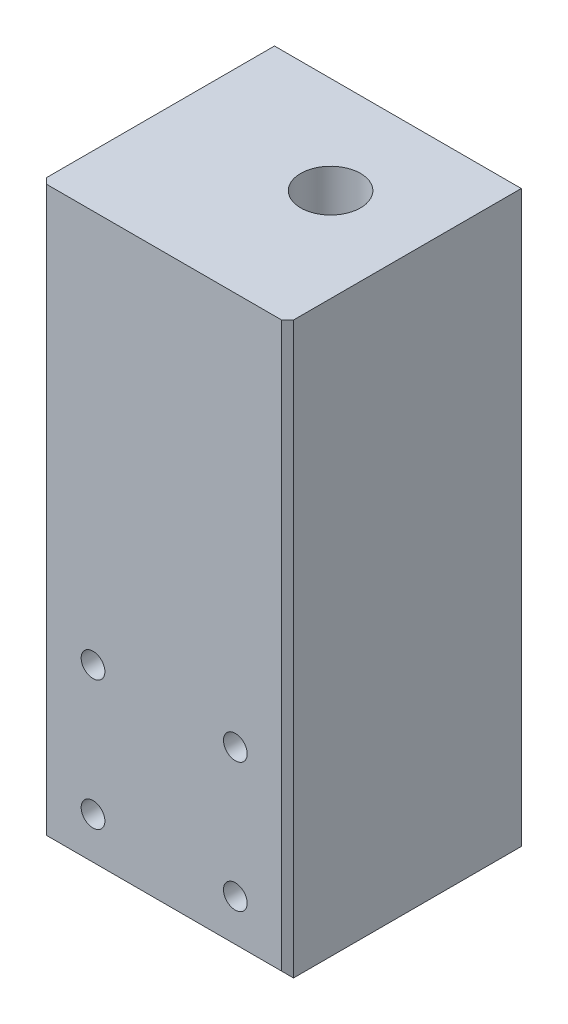
ISO-10303-21;
HEADER;
FILE_DESCRIPTION(('STEP AP214'),'2;1');
FILE_NAME('part.step','',(''),(''),'','','');
FILE_SCHEMA(('AUTOMOTIVE_DESIGN { 1 0 10303 214 1 1 1 1 }'));
ENDSEC;
DATA;
#1=APPLICATION_CONTEXT('core data for automotive mechanical design processes');
#2=APPLICATION_PROTOCOL_DEFINITION('international standard','automotive_design',2000,#1);
#3=PRODUCT_CONTEXT('',#1,'mechanical');
#4=PRODUCT('Part','Part','',(#3));
#5=PRODUCT_RELATED_PRODUCT_CATEGORY('part','',(#4));
#6=PRODUCT_DEFINITION_FORMATION('','',#4);
#7=PRODUCT_DEFINITION_CONTEXT('part definition',#1,'design');
#8=PRODUCT_DEFINITION('design','',#6,#7);
#9=PRODUCT_DEFINITION_SHAPE('','',#8);
#10=(LENGTH_UNIT() NAMED_UNIT(*) SI_UNIT(.MILLI.,.METRE.));
#11=(NAMED_UNIT(*) PLANE_ANGLE_UNIT() SI_UNIT($,.RADIAN.));
#12=(NAMED_UNIT(*) SI_UNIT($,.STERADIAN.) SOLID_ANGLE_UNIT());
#13=UNCERTAINTY_MEASURE_WITH_UNIT(LENGTH_MEASURE(1.E-05),#10,'distance_accuracy_value','');
#14=(GEOMETRIC_REPRESENTATION_CONTEXT(3) GLOBAL_UNCERTAINTY_ASSIGNED_CONTEXT((#13)) GLOBAL_UNIT_ASSIGNED_CONTEXT((#10,
#11,#12)) REPRESENTATION_CONTEXT('',''));
#15=CARTESIAN_POINT('',(0.,0.,0.));
#16=DIRECTION('',(0.,0.,1.));
#17=DIRECTION('',(1.,0.,0.));
#18=AXIS2_PLACEMENT_3D('',#15,#16,#17);
#19=CARTESIAN_POINT('',(145.625,0.,-87.900000000003));
#20=DIRECTION('',(1.,0.,0.));
#21=DIRECTION('',(0.,0.,-1.));
#22=AXIS2_PLACEMENT_3D('',#19,#20,#21);
#23=PLANE('',#22);
#24=DIRECTION('',(0.,0.,1.));
#25=VECTOR('',#24,1.);
#26=CARTESIAN_POINT('',(145.625,152.4,-87.900000000003));
#27=LINE('',#26,#25);
#28=CARTESIAN_POINT('',(145.625,152.4,-87.900000000003));
#29=VERTEX_POINT('',#28);
#30=CARTESIAN_POINT('',(145.625,152.4,-26.9875));
#31=VERTEX_POINT('',#30);
#32=EDGE_CURVE('E94',#29,#31,#27,.T.);
#33=ORIENTED_EDGE('',*,*,#32,.T.);
#34=DIRECTION('',(0.,-1.,0.));
#35=VECTOR('',#34,1.);
#36=CARTESIAN_POINT('',(145.625,0.,-26.9875));
#37=LINE('',#36,#35);
#38=CARTESIAN_POINT('',(145.625,0.,-26.9875));
#39=VERTEX_POINT('',#38);
#40=EDGE_CURVE('E64',#31,#39,#37,.T.);
#41=ORIENTED_EDGE('',*,*,#40,.T.);
#42=DIRECTION('',(0.,0.,1.));
#43=VECTOR('',#42,1.);
#44=CARTESIAN_POINT('',(145.625,0.,-87.900000000003));
#45=LINE('',#44,#43);
#46=CARTESIAN_POINT('',(145.625,0.,-87.900000000003));
#47=VERTEX_POINT('',#46);
#48=EDGE_CURVE('E113',#47,#39,#45,.T.);
#49=ORIENTED_EDGE('',*,*,#48,.F.);
#50=DIRECTION('',(0.,1.,0.));
#51=VECTOR('',#50,1.);
#52=CARTESIAN_POINT('',(145.625,0.,-87.900000000003));
#53=LINE('',#52,#51);
#54=EDGE_CURVE('E108',#47,#29,#53,.T.);
#55=ORIENTED_EDGE('',*,*,#54,.T.);
#56=EDGE_LOOP('',(#33,#41,#49,#55));
#57=FACE_BOUND('',#56,.T.);
#58=ADVANCED_FACE('F39',(#57),#23,.T.);
#59=CARTESIAN_POINT('',(0.,0.,-87.900000000003));
#60=DIRECTION('',(0.,1.,0.));
#61=DIRECTION('',(0.,0.,1.));
#62=AXIS2_PLACEMENT_3D('',#59,#60,#61);
#63=PLANE('',#62);
#64=CARTESIAN_POINT('',(120.624999999984,0.,-61.900000000027));
#65=DIRECTION('',(0.,-1.,0.));
#66=DIRECTION('',(0.,0.,-1.));
#67=AXIS2_PLACEMENT_3D('',#64,#65,#66);
#68=CIRCLE('',#67,8.00000000000001);
#69=CARTESIAN_POINT('',(120.624999999984,0.,-69.900000000027));
#70=VERTEX_POINT('',#69);
#71=EDGE_CURVE('E423',#70,#70,#68,.T.);
#72=ORIENTED_EDGE('',*,*,#71,.F.);
#73=EDGE_LOOP('',(#72));
#74=FACE_BOUND('',#73,.T.);
#75=CARTESIAN_POINT('',(134.060028842528,0.,-48.4649711574826));
#76=DIRECTION('',(0.,-1.,0.));
#77=DIRECTION('',(0.,0.,-1.));
#78=AXIS2_PLACEMENT_3D('',#75,#76,#77);
#79=CIRCLE('',#78,2.75000000000003);
#80=CARTESIAN_POINT('',(134.060028842528,0.,-51.2149711574826));
#81=VERTEX_POINT('',#80);
#82=EDGE_CURVE('E158',#81,#81,#79,.T.);
#83=ORIENTED_EDGE('',*,*,#82,.F.);
#84=EDGE_LOOP('',(#83));
#85=FACE_BOUND('',#84,.T.);
#86=CARTESIAN_POINT('',(120.624999999984,0.,-42.9000000000271));
#87=DIRECTION('',(0.,-1.,0.));
#88=DIRECTION('',(0.,0.,-1.));
#89=AXIS2_PLACEMENT_3D('',#86,#87,#88);
#90=CIRCLE('',#89,2.75);
#91=CARTESIAN_POINT('',(120.624999999984,0.,-45.6500000000271));
#92=VERTEX_POINT('',#91);
#93=EDGE_CURVE('E447',#92,#92,#90,.T.);
#94=ORIENTED_EDGE('',*,*,#93,.F.);
#95=EDGE_LOOP('',(#94));
#96=FACE_BOUND('',#95,.T.);
#97=CARTESIAN_POINT('',(107.189971157439,0.,-48.4649711574826));
#98=DIRECTION('',(0.,-1.,0.));
#99=DIRECTION('',(0.,0.,-1.));
#100=AXIS2_PLACEMENT_3D('',#97,#98,#99);
#101=CIRCLE('',#100,2.75000000000003);
#102=CARTESIAN_POINT('',(107.189971157439,0.,-51.2149711574826));
#103=VERTEX_POINT('',#102);
#104=EDGE_CURVE('E441',#103,#103,#101,.T.);
#105=ORIENTED_EDGE('',*,*,#104,.F.);
#106=EDGE_LOOP('',(#105));
#107=FACE_BOUND('',#106,.T.);
#108=CARTESIAN_POINT('',(107.189971157439,0.,-75.3350288425715));
#109=DIRECTION('',(0.,-1.,0.));
#110=DIRECTION('',(0.,0.,-1.));
#111=AXIS2_PLACEMENT_3D('',#108,#109,#110);
#112=CIRCLE('',#111,2.75000000000003);
#113=CARTESIAN_POINT('',(107.189971157439,0.,-78.0850288425716));
#114=VERTEX_POINT('',#113);
#115=EDGE_CURVE('E435',#114,#114,#112,.T.);
#116=ORIENTED_EDGE('',*,*,#115,.F.);
#117=EDGE_LOOP('',(#116));
#118=FACE_BOUND('',#117,.T.);
#119=CARTESIAN_POINT('',(120.624999999984,0.,-80.900000000027));
#120=DIRECTION('',(0.,-1.,0.));
#121=DIRECTION('',(0.,0.,-1.));
#122=AXIS2_PLACEMENT_3D('',#119,#120,#121);
#123=CIRCLE('',#122,2.75);
#124=CARTESIAN_POINT('',(120.624999999984,0.,-83.650000000027));
#125=VERTEX_POINT('',#124);
#126=EDGE_CURVE('E429',#125,#125,#123,.T.);
#127=ORIENTED_EDGE('',*,*,#126,.F.);
#128=EDGE_LOOP('',(#127));
#129=FACE_BOUND('',#128,.T.);
#130=CARTESIAN_POINT('',(134.060028842528,0.,-75.3350288425715));
#131=DIRECTION('',(0.,-1.,0.));
#132=DIRECTION('',(0.,0.,-1.));
#133=AXIS2_PLACEMENT_3D('',#130,#131,#132);
#134=CIRCLE('',#133,2.75000000000003);
#135=CARTESIAN_POINT('',(134.060028842528,0.,-78.0850288425716));
#136=VERTEX_POINT('',#135);
#137=EDGE_CURVE('E150',#136,#136,#134,.T.);
#138=ORIENTED_EDGE('',*,*,#137,.F.);
#139=EDGE_LOOP('',(#138));
#140=FACE_BOUND('',#139,.T.);
#141=ORIENTED_EDGE('',*,*,#48,.T.);
#142=DIRECTION('',(-1.,0.,0.));
#143=VECTOR('',#142,1.);
#144=CARTESIAN_POINT('',(79.6250000000006,0.,-26.9875));
#145=LINE('',#144,#143);
#146=CARTESIAN_POINT('',(79.6250000000006,0.,-26.9875));
#147=VERTEX_POINT('',#146);
#148=EDGE_CURVE('E49',#39,#147,#145,.T.);
#149=ORIENTED_EDGE('',*,*,#148,.T.);
#150=DIRECTION('',(0.,0.,1.));
#151=VECTOR('',#150,1.);
#152=CARTESIAN_POINT('',(79.6250000000006,0.,-87.900000000003));
#153=LINE('',#152,#151);
#154=CARTESIAN_POINT('',(79.6250000000006,0.,-87.900000000003));
#155=VERTEX_POINT('',#154);
#156=EDGE_CURVE('E128',#155,#147,#153,.T.);
#157=ORIENTED_EDGE('',*,*,#156,.F.);
#158=DIRECTION('',(-1.,0.,0.));
#159=VECTOR('',#158,1.);
#160=CARTESIAN_POINT('',(0.,0.,-87.900000000003));
#161=LINE('',#160,#159);
#162=EDGE_CURVE('E103',#47,#155,#161,.T.);
#163=ORIENTED_EDGE('',*,*,#162,.F.);
#164=EDGE_LOOP('',(#141,#149,#157,#163));
#165=FACE_BOUND('',#164,.T.);
#166=ADVANCED_FACE('F260',(#74,#85,#96,#107,#118,#129,#140,#165),#63,.F.);
#167=CARTESIAN_POINT('',(79.6250000000006,0.,-87.900000000003));
#168=DIRECTION('',(1.,0.,0.));
#169=DIRECTION('',(0.,0.,-1.));
#170=AXIS2_PLACEMENT_3D('',#167,#168,#169);
#171=PLANE('',#170);
#172=ORIENTED_EDGE('',*,*,#156,.T.);
#173=DIRECTION('',(0.,1.,0.));
#174=VECTOR('',#173,1.);
#175=CARTESIAN_POINT('',(79.6250000000006,152.4,-26.9875));
#176=LINE('',#175,#174);
#177=CARTESIAN_POINT('',(79.6250000000006,152.4,-26.9875));
#178=VERTEX_POINT('',#177);
#179=EDGE_CURVE('E11',#147,#178,#176,.T.);
#180=ORIENTED_EDGE('',*,*,#179,.T.);
#181=DIRECTION('',(0.,0.,1.));
#182=VECTOR('',#181,1.);
#183=CARTESIAN_POINT('',(79.6250000000006,152.4,-87.900000000003));
#184=LINE('',#183,#182);
#185=CARTESIAN_POINT('',(79.6250000000006,152.4,-87.900000000003));
#186=VERTEX_POINT('',#185);
#187=EDGE_CURVE('E102',#186,#178,#184,.T.);
#188=ORIENTED_EDGE('',*,*,#187,.F.);
#189=DIRECTION('',(0.,1.,0.));
#190=VECTOR('',#189,1.);
#191=CARTESIAN_POINT('',(79.6250000000006,0.,-87.900000000003));
#192=LINE('',#191,#190);
#193=EDGE_CURVE('E110',#155,#186,#192,.T.);
#194=ORIENTED_EDGE('',*,*,#193,.F.);
#195=EDGE_LOOP('',(#172,#180,#188,#194));
#196=FACE_BOUND('',#195,.T.);
#197=ADVANCED_FACE('F264',(#196),#171,.F.);
#198=CARTESIAN_POINT('',(0.,152.4,-87.900000000003));
#199=DIRECTION('',(0.,1.,0.));
#200=DIRECTION('',(0.,0.,1.));
#201=AXIS2_PLACEMENT_3D('',#198,#199,#200);
#202=PLANE('',#201);
#203=CARTESIAN_POINT('',(120.624999999984,152.4,-61.900000000027));
#204=DIRECTION('',(0.,-1.,0.));
#205=DIRECTION('',(0.,0.,-1.));
#206=AXIS2_PLACEMENT_3D('',#203,#204,#205);
#207=CIRCLE('',#206,8.00000000000001);
#208=CARTESIAN_POINT('',(120.624999999984,152.4,-69.900000000027));
#209=VERTEX_POINT('',#208);
#210=EDGE_CURVE('E420',#209,#209,#207,.T.);
#211=ORIENTED_EDGE('',*,*,#210,.T.);
#212=EDGE_LOOP('',(#211));
#213=FACE_BOUND('',#212,.T.);
#214=DIRECTION('',(-1.,0.,0.));
#215=VECTOR('',#214,1.);
#216=CARTESIAN_POINT('',(0.,152.4,-25.4));
#217=LINE('',#216,#215);
#218=CARTESIAN_POINT('',(144.0375,152.4,-25.4));
#219=VERTEX_POINT('',#218);
#220=CARTESIAN_POINT('',(81.2125000000006,152.4,-25.4));
#221=VERTEX_POINT('',#220);
#222=EDGE_CURVE('E115',#219,#221,#217,.T.);
#223=ORIENTED_EDGE('',*,*,#222,.F.);
#224=DIRECTION('',(-0.707106781186554,0.,0.707106781186541));
#225=VECTOR('',#224,1.);
#226=CARTESIAN_POINT('',(103.26875,152.4,15.3687499999991));
#227=LINE('',#226,#225);
#228=EDGE_CURVE('E100',#219,#31,#227,.F.);
#229=ORIENTED_EDGE('',*,*,#228,.T.);
#230=ORIENTED_EDGE('',*,*,#32,.F.);
#231=DIRECTION('',(-1.,0.,0.));
#232=VECTOR('',#231,1.);
#233=CARTESIAN_POINT('',(0.,152.4,-87.900000000003));
#234=LINE('',#233,#232);
#235=EDGE_CURVE('E99',#29,#186,#234,.T.);
#236=ORIENTED_EDGE('',*,*,#235,.T.);
#237=ORIENTED_EDGE('',*,*,#187,.T.);
#238=DIRECTION('',(0.707106781186554,0.,0.707106781186541));
#239=VECTOR('',#238,1.);
#240=CARTESIAN_POINT('',(9.3562499999981,152.4,-97.2562500000013));
#241=LINE('',#240,#239);
#242=EDGE_CURVE('E137',#178,#221,#241,.T.);
#243=ORIENTED_EDGE('',*,*,#242,.T.);
#244=EDGE_LOOP('',(#223,#229,#230,#236,#237,#243));
#245=FACE_BOUND('',#244,.T.);
#246=ADVANCED_FACE('F97',(#213,#245),#202,.T.);
#247=CARTESIAN_POINT('',(0.,0.,-87.900000000003));
#248=DIRECTION('',(0.,0.,1.));
#249=DIRECTION('',(1.,0.,0.));
#250=AXIS2_PLACEMENT_3D('',#247,#248,#249);
#251=PLANE('',#250);
#252=CARTESIAN_POINT('',(139.275,36.3250000000134,-87.900000000003));
#253=DIRECTION('',(0.,0.,1.));
#254=DIRECTION('',(1.,0.,0.));
#255=AXIS2_PLACEMENT_3D('',#252,#253,#254);
#256=CIRCLE('',#255,1.58749999999999);
#257=CARTESIAN_POINT('',(140.8625,36.3250000000134,-87.900000000003));
#258=VERTEX_POINT('',#257);
#259=EDGE_CURVE('E164',#258,#258,#256,.T.);
#260=ORIENTED_EDGE('',*,*,#259,.T.);
#261=EDGE_LOOP('',(#260));
#262=FACE_BOUND('',#261,.T.);
#263=CARTESIAN_POINT('',(85.6250000000003,7.00000000000009,-87.900000000003));
#264=DIRECTION('',(0.,0.,1.));
#265=DIRECTION('',(1.,0.,0.));
#266=AXIS2_PLACEMENT_3D('',#263,#264,#265);
#267=CIRCLE('',#266,3.3);
#268=CARTESIAN_POINT('',(88.9250000000003,7.00000000000009,-87.900000000003));
#269=VERTEX_POINT('',#268);
#270=EDGE_CURVE('E183',#269,#269,#267,.T.);
#271=ORIENTED_EDGE('',*,*,#270,.T.);
#272=EDGE_LOOP('',(#271));
#273=FACE_BOUND('',#272,.T.);
#274=CARTESIAN_POINT('',(98.6250000000003,7.00000000000009,-87.900000000003));
#275=DIRECTION('',(0.,0.,1.));
#276=DIRECTION('',(1.,0.,0.));
#277=AXIS2_PLACEMENT_3D('',#274,#275,#276);
#278=CIRCLE('',#277,3.3);
#279=CARTESIAN_POINT('',(101.925,7.00000000000009,-87.900000000003));
#280=VERTEX_POINT('',#279);
#281=EDGE_CURVE('E182',#280,#280,#278,.T.);
#282=ORIENTED_EDGE('',*,*,#281,.T.);
#283=EDGE_LOOP('',(#282));
#284=FACE_BOUND('',#283,.T.);
#285=CARTESIAN_POINT('',(85.6250000000003,53.0000000000001,-87.900000000003));
#286=DIRECTION('',(0.,0.,1.));
#287=DIRECTION('',(1.,0.,0.));
#288=AXIS2_PLACEMENT_3D('',#285,#286,#287);
#289=CIRCLE('',#288,3.3);
#290=CARTESIAN_POINT('',(88.9250000000003,53.0000000000001,-87.900000000003));
#291=VERTEX_POINT('',#290);
#292=EDGE_CURVE('E195',#291,#291,#289,.T.);
#293=ORIENTED_EDGE('',*,*,#292,.T.);
#294=EDGE_LOOP('',(#293));
#295=FACE_BOUND('',#294,.T.);
#296=CARTESIAN_POINT('',(113.875,36.3250000000134,-87.900000000003));
#297=DIRECTION('',(0.,0.,1.));
#298=DIRECTION('',(1.,0.,0.));
#299=AXIS2_PLACEMENT_3D('',#296,#297,#298);
#300=CIRCLE('',#299,1.58749999999999);
#301=CARTESIAN_POINT('',(115.4625,36.3250000000134,-87.900000000003));
#302=VERTEX_POINT('',#301);
#303=EDGE_CURVE('E165',#302,#302,#300,.T.);
#304=ORIENTED_EDGE('',*,*,#303,.T.);
#305=EDGE_LOOP('',(#304));
#306=FACE_BOUND('',#305,.T.);
#307=CARTESIAN_POINT('',(113.875,23.6750000000135,-87.900000000003));
#308=DIRECTION('',(0.,0.,1.));
#309=DIRECTION('',(1.,0.,0.));
#310=AXIS2_PLACEMENT_3D('',#307,#308,#309);
#311=CIRCLE('',#310,1.58750000000001);
#312=CARTESIAN_POINT('',(115.4625,23.6750000000135,-87.900000000003));
#313=VERTEX_POINT('',#312);
#314=EDGE_CURVE('E171',#313,#313,#311,.T.);
#315=ORIENTED_EDGE('',*,*,#314,.T.);
#316=EDGE_LOOP('',(#315));
#317=FACE_BOUND('',#316,.T.);
#318=CARTESIAN_POINT('',(139.275,23.6750000000135,-87.900000000003));
#319=DIRECTION('',(0.,0.,1.));
#320=DIRECTION('',(1.,0.,0.));
#321=AXIS2_PLACEMENT_3D('',#318,#319,#320);
#322=CIRCLE('',#321,1.58750000000001);
#323=CARTESIAN_POINT('',(140.8625,23.6750000000135,-87.900000000003));
#324=VERTEX_POINT('',#323);
#325=EDGE_CURVE('E148',#324,#324,#322,.T.);
#326=ORIENTED_EDGE('',*,*,#325,.T.);
#327=EDGE_LOOP('',(#326));
#328=FACE_BOUND('',#327,.T.);
#329=CARTESIAN_POINT('',(98.6250000000003,53.0000000000001,-87.900000000003));
#330=DIRECTION('',(0.,0.,1.));
#331=DIRECTION('',(1.,0.,0.));
#332=AXIS2_PLACEMENT_3D('',#329,#330,#331);
#333=CIRCLE('',#332,3.3);
#334=CARTESIAN_POINT('',(101.925,53.0000000000001,-87.900000000003));
#335=VERTEX_POINT('',#334);
#336=EDGE_CURVE('E194',#335,#335,#333,.T.);
#337=ORIENTED_EDGE('',*,*,#336,.T.);
#338=EDGE_LOOP('',(#337));
#339=FACE_BOUND('',#338,.T.);
#340=ORIENTED_EDGE('',*,*,#54,.F.);
#341=ORIENTED_EDGE('',*,*,#162,.T.);
#342=ORIENTED_EDGE('',*,*,#193,.T.);
#343=ORIENTED_EDGE('',*,*,#235,.F.);
#344=EDGE_LOOP('',(#340,#341,#342,#343));
#345=FACE_BOUND('',#344,.T.);
#346=ADVANCED_FACE('F107',(#262,#273,#284,#295,#306,#317,#328,#339,#345),#251,.F.);
#347=CARTESIAN_POINT('',(0.,0.,-25.4));
#348=DIRECTION('',(0.,0.,1.));
#349=DIRECTION('',(1.,0.,0.));
#350=AXIS2_PLACEMENT_3D('',#347,#348,#349);
#351=PLANE('',#350);
#352=CARTESIAN_POINT('',(131.655,12.7,-25.4));
#353=DIRECTION('',(0.,0.,1.));
#354=DIRECTION('',(1.,0.,0.));
#355=AXIS2_PLACEMENT_3D('',#352,#353,#354);
#356=CIRCLE('',#355,3.175);
#357=CARTESIAN_POINT('',(134.83,12.7,-25.4));
#358=VERTEX_POINT('',#357);
#359=EDGE_CURVE('E212',#358,#358,#356,.T.);
#360=ORIENTED_EDGE('',*,*,#359,.F.);
#361=EDGE_LOOP('',(#360));
#362=FACE_BOUND('',#361,.T.);
#363=CARTESIAN_POINT('',(93.5950000000005,47.3000000000001,-25.4));
#364=DIRECTION('',(0.,0.,1.));
#365=DIRECTION('',(1.,0.,0.));
#366=AXIS2_PLACEMENT_3D('',#363,#364,#365);
#367=CIRCLE('',#366,3.175);
#368=CARTESIAN_POINT('',(96.7700000000005,47.3000000000001,-25.4));
#369=VERTEX_POINT('',#368);
#370=EDGE_CURVE('E218',#369,#369,#367,.T.);
#371=ORIENTED_EDGE('',*,*,#370,.F.);
#372=EDGE_LOOP('',(#371));
#373=FACE_BOUND('',#372,.T.);
#374=CARTESIAN_POINT('',(131.655,47.3000000000001,-25.4));
#375=DIRECTION('',(0.,0.,1.));
#376=DIRECTION('',(1.,0.,0.));
#377=AXIS2_PLACEMENT_3D('',#374,#375,#376);
#378=CIRCLE('',#377,3.175);
#379=CARTESIAN_POINT('',(134.83,47.3000000000001,-25.4));
#380=VERTEX_POINT('',#379);
#381=EDGE_CURVE('E121',#380,#380,#378,.T.);
#382=ORIENTED_EDGE('',*,*,#381,.F.);
#383=EDGE_LOOP('',(#382));
#384=FACE_BOUND('',#383,.T.);
#385=CARTESIAN_POINT('',(93.5950000000005,12.7,-25.4));
#386=DIRECTION('',(0.,0.,1.));
#387=DIRECTION('',(1.,0.,0.));
#388=AXIS2_PLACEMENT_3D('',#385,#386,#387);
#389=CIRCLE('',#388,3.175);
#390=CARTESIAN_POINT('',(96.7700000000005,12.7,-25.4));
#391=VERTEX_POINT('',#390);
#392=EDGE_CURVE('E206',#391,#391,#389,.T.);
#393=ORIENTED_EDGE('',*,*,#392,.F.);
#394=EDGE_LOOP('',(#393));
#395=FACE_BOUND('',#394,.T.);
#396=DIRECTION('',(1.,0.,0.));
#397=VECTOR('',#396,1.);
#398=CARTESIAN_POINT('',(145.625,1.58750000000002,-25.4));
#399=LINE('',#398,#397);
#400=CARTESIAN_POINT('',(81.2125000000006,1.58750000000002,-25.4));
#401=VERTEX_POINT('',#400);
#402=CARTESIAN_POINT('',(144.0375,1.58750000000002,-25.4));
#403=VERTEX_POINT('',#402);
#404=EDGE_CURVE('E132',#401,#403,#399,.T.);
#405=ORIENTED_EDGE('',*,*,#404,.T.);
#406=DIRECTION('',(0.,1.,0.));
#407=VECTOR('',#406,1.);
#408=CARTESIAN_POINT('',(144.0375,0.,-25.4));
#409=LINE('',#408,#407);
#410=EDGE_CURVE('E134',#403,#219,#409,.T.);
#411=ORIENTED_EDGE('',*,*,#410,.T.);
#412=ORIENTED_EDGE('',*,*,#222,.T.);
#413=DIRECTION('',(0.,-1.,0.));
#414=VECTOR('',#413,1.);
#415=CARTESIAN_POINT('',(81.2125000000006,0.,-25.4));
#416=LINE('',#415,#414);
#417=EDGE_CURVE('E127',#221,#401,#416,.T.);
#418=ORIENTED_EDGE('',*,*,#417,.T.);
#419=EDGE_LOOP('',(#405,#411,#412,#418));
#420=FACE_BOUND('',#419,.T.);
#421=ADVANCED_FACE('F233',(#362,#373,#384,#395,#420),#351,.T.);
#422=CARTESIAN_POINT('',(93.5950000000005,12.7,-50.8));
#423=DIRECTION('',(0.,0.,1.));
#424=DIRECTION('',(1.,0.,0.));
#425=AXIS2_PLACEMENT_3D('',#422,#423,#424);
#426=CYLINDRICAL_SURFACE('',#425,3.175);
#427=CARTESIAN_POINT('',(93.5950000000005,12.7,-50.8));
#428=DIRECTION('',(0.,0.,1.));
#429=DIRECTION('',(1.,0.,0.));
#430=AXIS2_PLACEMENT_3D('',#427,#428,#429);
#431=CIRCLE('',#430,3.175);
#432=CARTESIAN_POINT('',(96.7700000000005,12.7,-50.8));
#433=VERTEX_POINT('',#432);
#434=EDGE_CURVE('E209',#433,#433,#431,.T.);
#435=ORIENTED_EDGE('',*,*,#434,.F.);
#436=EDGE_LOOP('',(#435));
#437=FACE_BOUND('',#436,.T.);
#438=ORIENTED_EDGE('',*,*,#392,.T.);
#439=EDGE_LOOP('',(#438));
#440=FACE_BOUND('',#439,.T.);
#441=ADVANCED_FACE('F236',(#437,#440),#426,.F.);
#442=CARTESIAN_POINT('',(93.5950000000005,12.7,-50.8));
#443=DIRECTION('',(0.,0.,1.));
#444=DIRECTION('',(1.,0.,0.));
#445=AXIS2_PLACEMENT_3D('',#442,#443,#444);
#446=PLANE('',#445);
#447=ORIENTED_EDGE('',*,*,#434,.T.);
#448=EDGE_LOOP('',(#447));
#449=FACE_BOUND('',#448,.T.);
#450=ADVANCED_FACE('F280',(#449),#446,.T.);
#451=CARTESIAN_POINT('',(131.655,47.3000000000001,-50.8));
#452=DIRECTION('',(0.,0.,1.));
#453=DIRECTION('',(1.,0.,0.));
#454=AXIS2_PLACEMENT_3D('',#451,#452,#453);
#455=CYLINDRICAL_SURFACE('',#454,3.175);
#456=CARTESIAN_POINT('',(131.655,47.3000000000001,-50.8));
#457=DIRECTION('',(0.,0.,1.));
#458=DIRECTION('',(1.,0.,0.));
#459=AXIS2_PLACEMENT_3D('',#456,#457,#458);
#460=CIRCLE('',#459,3.175);
#461=CARTESIAN_POINT('',(134.83,47.3000000000001,-50.8));
#462=VERTEX_POINT('',#461);
#463=EDGE_CURVE('E118',#462,#462,#460,.T.);
#464=ORIENTED_EDGE('',*,*,#463,.F.);
#465=EDGE_LOOP('',(#464));
#466=FACE_BOUND('',#465,.T.);
#467=ORIENTED_EDGE('',*,*,#381,.T.);
#468=EDGE_LOOP('',(#467));
#469=FACE_BOUND('',#468,.T.);
#470=ADVANCED_FACE('F231',(#466,#469),#455,.F.);
#471=CARTESIAN_POINT('',(131.655,47.3000000000001,-50.8));
#472=DIRECTION('',(0.,0.,1.));
#473=DIRECTION('',(1.,0.,0.));
#474=AXIS2_PLACEMENT_3D('',#471,#472,#473);
#475=PLANE('',#474);
#476=ORIENTED_EDGE('',*,*,#463,.T.);
#477=EDGE_LOOP('',(#476));
#478=FACE_BOUND('',#477,.T.);
#479=ADVANCED_FACE('F279',(#478),#475,.T.);
#480=CARTESIAN_POINT('',(93.5950000000005,47.3000000000001,-50.8));
#481=DIRECTION('',(0.,0.,1.));
#482=DIRECTION('',(1.,0.,0.));
#483=AXIS2_PLACEMENT_3D('',#480,#481,#482);
#484=CYLINDRICAL_SURFACE('',#483,3.175);
#485=CARTESIAN_POINT('',(93.5950000000005,47.3000000000001,-50.8));
#486=DIRECTION('',(0.,0.,1.));
#487=DIRECTION('',(1.,0.,0.));
#488=AXIS2_PLACEMENT_3D('',#485,#486,#487);
#489=CIRCLE('',#488,3.175);
#490=CARTESIAN_POINT('',(96.7700000000005,47.3000000000001,-50.8));
#491=VERTEX_POINT('',#490);
#492=EDGE_CURVE('E215',#491,#491,#489,.T.);
#493=ORIENTED_EDGE('',*,*,#492,.F.);
#494=EDGE_LOOP('',(#493));
#495=FACE_BOUND('',#494,.T.);
#496=ORIENTED_EDGE('',*,*,#370,.T.);
#497=EDGE_LOOP('',(#496));
#498=FACE_BOUND('',#497,.T.);
#499=ADVANCED_FACE('F284',(#495,#498),#484,.F.);
#500=CARTESIAN_POINT('',(93.5950000000005,47.3000000000001,-50.8));
#501=DIRECTION('',(0.,0.,1.));
#502=DIRECTION('',(1.,0.,0.));
#503=AXIS2_PLACEMENT_3D('',#500,#501,#502);
#504=PLANE('',#503);
#505=ORIENTED_EDGE('',*,*,#492,.T.);
#506=EDGE_LOOP('',(#505));
#507=FACE_BOUND('',#506,.T.);
#508=ADVANCED_FACE('F289',(#507),#504,.T.);
#509=CARTESIAN_POINT('',(131.655,12.7,-50.8));
#510=DIRECTION('',(0.,0.,1.));
#511=DIRECTION('',(1.,0.,0.));
#512=AXIS2_PLACEMENT_3D('',#509,#510,#511);
#513=CYLINDRICAL_SURFACE('',#512,3.175);
#514=CARTESIAN_POINT('',(131.655,12.7,-50.8));
#515=DIRECTION('',(0.,0.,1.));
#516=DIRECTION('',(1.,0.,0.));
#517=AXIS2_PLACEMENT_3D('',#514,#515,#516);
#518=CIRCLE('',#517,3.175);
#519=CARTESIAN_POINT('',(134.83,12.7,-50.8));
#520=VERTEX_POINT('',#519);
#521=EDGE_CURVE('E221',#520,#520,#518,.T.);
#522=ORIENTED_EDGE('',*,*,#521,.F.);
#523=EDGE_LOOP('',(#522));
#524=FACE_BOUND('',#523,.T.);
#525=ORIENTED_EDGE('',*,*,#359,.T.);
#526=EDGE_LOOP('',(#525));
#527=FACE_BOUND('',#526,.T.);
#528=ADVANCED_FACE('F285',(#524,#527),#513,.F.);
#529=CARTESIAN_POINT('',(131.655,12.7,-50.8));
#530=DIRECTION('',(0.,0.,1.));
#531=DIRECTION('',(1.,0.,0.));
#532=AXIS2_PLACEMENT_3D('',#529,#530,#531);
#533=PLANE('',#532);
#534=ORIENTED_EDGE('',*,*,#521,.T.);
#535=EDGE_LOOP('',(#534));
#536=FACE_BOUND('',#535,.T.);
#537=ADVANCED_FACE('F288',(#536),#533,.T.);
#538=CARTESIAN_POINT('',(98.6250000000003,53.0000000000001,-81.5500000000031));
#539=DIRECTION('',(0.,0.,-1.));
#540=DIRECTION('',(-1.,0.,0.));
#541=AXIS2_PLACEMENT_3D('',#538,#539,#540);
#542=CYLINDRICAL_SURFACE('',#541,3.3);
#543=CARTESIAN_POINT('',(98.6250000000003,53.0000000000001,-81.5500000000031));
#544=DIRECTION('',(0.,0.,1.));
#545=DIRECTION('',(1.,0.,0.));
#546=AXIS2_PLACEMENT_3D('',#543,#544,#545);
#547=CIRCLE('',#546,3.3);
#548=CARTESIAN_POINT('',(101.925,53.0000000000001,-81.5500000000031));
#549=VERTEX_POINT('',#548);
#550=EDGE_CURVE('E203',#549,#549,#547,.T.);
#551=ORIENTED_EDGE('',*,*,#550,.T.);
#552=EDGE_LOOP('',(#551));
#553=FACE_BOUND('',#552,.T.);
#554=ORIENTED_EDGE('',*,*,#336,.F.);
#555=EDGE_LOOP('',(#554));
#556=FACE_BOUND('',#555,.T.);
#557=ADVANCED_FACE('F293',(#553,#556),#542,.F.);
#558=CARTESIAN_POINT('',(98.6250000000003,53.0000000000001,-81.5500000000031));
#559=DIRECTION('',(0.,0.,1.));
#560=DIRECTION('',(1.,0.,0.));
#561=AXIS2_PLACEMENT_3D('',#558,#559,#560);
#562=PLANE('',#561);
#563=ORIENTED_EDGE('',*,*,#550,.F.);
#564=EDGE_LOOP('',(#563));
#565=FACE_BOUND('',#564,.T.);
#566=ADVANCED_FACE('F309',(#565),#562,.F.);
#567=CARTESIAN_POINT('',(139.275,23.6750000000135,-81.5500000000031));
#568=DIRECTION('',(0.,0.,-1.));
#569=DIRECTION('',(-1.,0.,0.));
#570=AXIS2_PLACEMENT_3D('',#567,#568,#569);
#571=CYLINDRICAL_SURFACE('',#570,1.58750000000001);
#572=CARTESIAN_POINT('',(139.275,23.6750000000135,-81.5500000000031));
#573=DIRECTION('',(0.,0.,1.));
#574=DIRECTION('',(1.,0.,0.));
#575=AXIS2_PLACEMENT_3D('',#572,#573,#574);
#576=CIRCLE('',#575,1.58750000000001);
#577=CARTESIAN_POINT('',(140.8625,23.6750000000135,-81.5500000000031));
#578=VERTEX_POINT('',#577);
#579=EDGE_CURVE('E174',#578,#578,#576,.T.);
#580=ORIENTED_EDGE('',*,*,#579,.T.);
#581=EDGE_LOOP('',(#580));
#582=FACE_BOUND('',#581,.T.);
#583=ORIENTED_EDGE('',*,*,#325,.F.);
#584=EDGE_LOOP('',(#583));
#585=FACE_BOUND('',#584,.T.);
#586=ADVANCED_FACE('F313',(#582,#585),#571,.F.);
#587=CARTESIAN_POINT('',(139.275,23.6750000000135,-81.5500000000031));
#588=DIRECTION('',(0.,0.,1.));
#589=DIRECTION('',(1.,0.,0.));
#590=AXIS2_PLACEMENT_3D('',#587,#588,#589);
#591=PLANE('',#590);
#592=ORIENTED_EDGE('',*,*,#579,.F.);
#593=EDGE_LOOP('',(#592));
#594=FACE_BOUND('',#593,.T.);
#595=ADVANCED_FACE('F350',(#594),#591,.F.);
#596=CARTESIAN_POINT('',(113.875,23.6750000000135,-81.5500000000031));
#597=DIRECTION('',(0.,0.,-1.));
#598=DIRECTION('',(-1.,0.,0.));
#599=AXIS2_PLACEMENT_3D('',#596,#597,#598);
#600=CYLINDRICAL_SURFACE('',#599,1.58750000000001);
#601=CARTESIAN_POINT('',(113.875,23.6750000000135,-81.5500000000031));
#602=DIRECTION('',(0.,0.,1.));
#603=DIRECTION('',(1.,0.,0.));
#604=AXIS2_PLACEMENT_3D('',#601,#602,#603);
#605=CIRCLE('',#604,1.58750000000001);
#606=CARTESIAN_POINT('',(115.4625,23.6750000000135,-81.5500000000031));
#607=VERTEX_POINT('',#606);
#608=EDGE_CURVE('E168',#607,#607,#605,.T.);
#609=ORIENTED_EDGE('',*,*,#608,.T.);
#610=EDGE_LOOP('',(#609));
#611=FACE_BOUND('',#610,.T.);
#612=ORIENTED_EDGE('',*,*,#314,.F.);
#613=EDGE_LOOP('',(#612));
#614=FACE_BOUND('',#613,.T.);
#615=ADVANCED_FACE('F354',(#611,#614),#600,.F.);
#616=CARTESIAN_POINT('',(113.875,23.6750000000135,-81.5500000000031));
#617=DIRECTION('',(0.,0.,1.));
#618=DIRECTION('',(1.,0.,0.));
#619=AXIS2_PLACEMENT_3D('',#616,#617,#618);
#620=PLANE('',#619);
#621=ORIENTED_EDGE('',*,*,#608,.F.);
#622=EDGE_LOOP('',(#621));
#623=FACE_BOUND('',#622,.T.);
#624=ADVANCED_FACE('F358',(#623),#620,.F.);
#625=CARTESIAN_POINT('',(113.875,36.3250000000134,-81.5500000000031));
#626=DIRECTION('',(0.,0.,-1.));
#627=DIRECTION('',(-1.,0.,0.));
#628=AXIS2_PLACEMENT_3D('',#625,#626,#627);
#629=CYLINDRICAL_SURFACE('',#628,1.58749999999999);
#630=CARTESIAN_POINT('',(113.875,36.3250000000134,-81.5500000000031));
#631=DIRECTION('',(0.,0.,1.));
#632=DIRECTION('',(1.,0.,0.));
#633=AXIS2_PLACEMENT_3D('',#630,#631,#632);
#634=CIRCLE('',#633,1.58749999999999);
#635=CARTESIAN_POINT('',(115.4625,36.3250000000134,-81.5500000000031));
#636=VERTEX_POINT('',#635);
#637=EDGE_CURVE('E161',#636,#636,#634,.T.);
#638=ORIENTED_EDGE('',*,*,#637,.T.);
#639=EDGE_LOOP('',(#638));
#640=FACE_BOUND('',#639,.T.);
#641=ORIENTED_EDGE('',*,*,#303,.F.);
#642=EDGE_LOOP('',(#641));
#643=FACE_BOUND('',#642,.T.);
#644=ADVANCED_FACE('F362',(#640,#643),#629,.F.);
#645=CARTESIAN_POINT('',(113.875,36.3250000000134,-81.5500000000031));
#646=DIRECTION('',(0.,0.,1.));
#647=DIRECTION('',(1.,0.,0.));
#648=AXIS2_PLACEMENT_3D('',#645,#646,#647);
#649=PLANE('',#648);
#650=ORIENTED_EDGE('',*,*,#637,.F.);
#651=EDGE_LOOP('',(#650));
#652=FACE_BOUND('',#651,.T.);
#653=ADVANCED_FACE('F328',(#652),#649,.F.);
#654=CARTESIAN_POINT('',(85.6250000000003,53.0000000000001,-81.5500000000031));
#655=DIRECTION('',(0.,0.,-1.));
#656=DIRECTION('',(-1.,0.,0.));
#657=AXIS2_PLACEMENT_3D('',#654,#655,#656);
#658=CYLINDRICAL_SURFACE('',#657,3.3);
#659=CARTESIAN_POINT('',(85.6250000000003,53.0000000000001,-81.5500000000031));
#660=DIRECTION('',(0.,0.,1.));
#661=DIRECTION('',(1.,0.,0.));
#662=AXIS2_PLACEMENT_3D('',#659,#660,#661);
#663=CIRCLE('',#662,3.3);
#664=CARTESIAN_POINT('',(88.9250000000003,53.0000000000001,-81.5500000000031));
#665=VERTEX_POINT('',#664);
#666=EDGE_CURVE('E191',#665,#665,#663,.T.);
#667=ORIENTED_EDGE('',*,*,#666,.T.);
#668=EDGE_LOOP('',(#667));
#669=FACE_BOUND('',#668,.T.);
#670=ORIENTED_EDGE('',*,*,#292,.F.);
#671=EDGE_LOOP('',(#670));
#672=FACE_BOUND('',#671,.T.);
#673=ADVANCED_FACE('F325',(#669,#672),#658,.F.);
#674=CARTESIAN_POINT('',(85.6250000000003,53.0000000000001,-81.5500000000031));
#675=DIRECTION('',(0.,0.,1.));
#676=DIRECTION('',(1.,0.,0.));
#677=AXIS2_PLACEMENT_3D('',#674,#675,#676);
#678=PLANE('',#677);
#679=ORIENTED_EDGE('',*,*,#666,.F.);
#680=EDGE_LOOP('',(#679));
#681=FACE_BOUND('',#680,.T.);
#682=ADVANCED_FACE('F319',(#681),#678,.F.);
#683=CARTESIAN_POINT('',(98.6250000000003,7.00000000000009,-81.5500000000031));
#684=DIRECTION('',(0.,0.,-1.));
#685=DIRECTION('',(-1.,0.,0.));
#686=AXIS2_PLACEMENT_3D('',#683,#684,#685);
#687=CYLINDRICAL_SURFACE('',#686,3.3);
#688=CARTESIAN_POINT('',(98.6250000000003,7.00000000000009,-81.5500000000031));
#689=DIRECTION('',(0.,0.,1.));
#690=DIRECTION('',(1.,0.,0.));
#691=AXIS2_PLACEMENT_3D('',#688,#689,#690);
#692=CIRCLE('',#691,3.3);
#693=CARTESIAN_POINT('',(101.925,7.00000000000009,-81.5500000000031));
#694=VERTEX_POINT('',#693);
#695=EDGE_CURVE('E198',#694,#694,#692,.T.);
#696=ORIENTED_EDGE('',*,*,#695,.T.);
#697=EDGE_LOOP('',(#696));
#698=FACE_BOUND('',#697,.T.);
#699=ORIENTED_EDGE('',*,*,#281,.F.);
#700=EDGE_LOOP('',(#699));
#701=FACE_BOUND('',#700,.T.);
#702=ADVANCED_FACE('F315',(#698,#701),#687,.F.);
#703=CARTESIAN_POINT('',(98.6250000000003,7.00000000000009,-81.5500000000031));
#704=DIRECTION('',(0.,0.,1.));
#705=DIRECTION('',(1.,0.,0.));
#706=AXIS2_PLACEMENT_3D('',#703,#704,#705);
#707=PLANE('',#706);
#708=ORIENTED_EDGE('',*,*,#695,.F.);
#709=EDGE_LOOP('',(#708));
#710=FACE_BOUND('',#709,.T.);
#711=ADVANCED_FACE('F318',(#710),#707,.F.);
#712=CARTESIAN_POINT('',(85.6250000000003,7.00000000000009,-81.5500000000031));
#713=DIRECTION('',(0.,0.,-1.));
#714=DIRECTION('',(-1.,0.,0.));
#715=AXIS2_PLACEMENT_3D('',#712,#713,#714);
#716=CYLINDRICAL_SURFACE('',#715,3.3);
#717=CARTESIAN_POINT('',(85.6250000000003,7.00000000000009,-81.5500000000031));
#718=DIRECTION('',(0.,0.,1.));
#719=DIRECTION('',(1.,0.,0.));
#720=AXIS2_PLACEMENT_3D('',#717,#718,#719);
#721=CIRCLE('',#720,3.3);
#722=CARTESIAN_POINT('',(88.9250000000003,7.00000000000009,-81.5500000000031));
#723=VERTEX_POINT('',#722);
#724=EDGE_CURVE('E179',#723,#723,#721,.T.);
#725=ORIENTED_EDGE('',*,*,#724,.T.);
#726=EDGE_LOOP('',(#725));
#727=FACE_BOUND('',#726,.T.);
#728=ORIENTED_EDGE('',*,*,#270,.F.);
#729=EDGE_LOOP('',(#728));
#730=FACE_BOUND('',#729,.T.);
#731=ADVANCED_FACE('F323',(#727,#730),#716,.F.);
#732=CARTESIAN_POINT('',(85.6250000000003,7.00000000000009,-81.5500000000031));
#733=DIRECTION('',(0.,0.,1.));
#734=DIRECTION('',(1.,0.,0.));
#735=AXIS2_PLACEMENT_3D('',#732,#733,#734);
#736=PLANE('',#735);
#737=ORIENTED_EDGE('',*,*,#724,.F.);
#738=EDGE_LOOP('',(#737));
#739=FACE_BOUND('',#738,.T.);
#740=ADVANCED_FACE('F337',(#739),#736,.F.);
#741=CARTESIAN_POINT('',(139.275,36.3250000000134,-81.5500000000031));
#742=DIRECTION('',(0.,0.,-1.));
#743=DIRECTION('',(-1.,0.,0.));
#744=AXIS2_PLACEMENT_3D('',#741,#742,#743);
#745=CYLINDRICAL_SURFACE('',#744,1.58749999999999);
#746=CARTESIAN_POINT('',(139.275,36.3250000000134,-81.5500000000031));
#747=DIRECTION('',(0.,0.,1.));
#748=DIRECTION('',(1.,0.,0.));
#749=AXIS2_PLACEMENT_3D('',#746,#747,#748);
#750=CIRCLE('',#749,1.58749999999999);
#751=CARTESIAN_POINT('',(140.8625,36.3250000000134,-81.5500000000031));
#752=VERTEX_POINT('',#751);
#753=EDGE_CURVE('E186',#752,#752,#750,.T.);
#754=ORIENTED_EDGE('',*,*,#753,.T.);
#755=EDGE_LOOP('',(#754));
#756=FACE_BOUND('',#755,.T.);
#757=ORIENTED_EDGE('',*,*,#259,.F.);
#758=EDGE_LOOP('',(#757));
#759=FACE_BOUND('',#758,.T.);
#760=ADVANCED_FACE('F333',(#756,#759),#745,.F.);
#761=CARTESIAN_POINT('',(139.275,36.3250000000134,-81.5500000000031));
#762=DIRECTION('',(0.,0.,1.));
#763=DIRECTION('',(1.,0.,0.));
#764=AXIS2_PLACEMENT_3D('',#761,#762,#763);
#765=PLANE('',#764);
#766=ORIENTED_EDGE('',*,*,#753,.F.);
#767=EDGE_LOOP('',(#766));
#768=FACE_BOUND('',#767,.T.);
#769=ADVANCED_FACE('F336',(#768),#765,.F.);
#770=CARTESIAN_POINT('',(79.6250000000006,0.,-26.9875));
#771=DIRECTION('',(-0.707106781186541,0.,0.707106781186554));
#772=DIRECTION('',(0.,-1.,0.));
#773=AXIS2_PLACEMENT_3D('',#770,#771,#772);
#774=PLANE('',#773);
#775=ORIENTED_EDGE('',*,*,#242,.F.);
#776=ORIENTED_EDGE('',*,*,#179,.F.);
#777=DIRECTION('',(0.577350269189629,0.577350269189629,0.577350269189619));
#778=VECTOR('',#777,1.);
#779=CARTESIAN_POINT('',(79.6250000000006,0.,-26.9875));
#780=LINE('',#779,#778);
#781=EDGE_CURVE('E44',#401,#147,#780,.F.);
#782=ORIENTED_EDGE('',*,*,#781,.F.);
#783=ORIENTED_EDGE('',*,*,#417,.F.);
#784=EDGE_LOOP('',(#775,#776,#782,#783));
#785=FACE_BOUND('',#784,.T.);
#786=ADVANCED_FACE('F42',(#785),#774,.T.);
#787=CARTESIAN_POINT('',(0.,0.,-26.9875));
#788=DIRECTION('',(0.,-0.707106781186541,0.707106781186554));
#789=DIRECTION('',(1.,0.,0.));
#790=AXIS2_PLACEMENT_3D('',#787,#788,#789);
#791=PLANE('',#790);
#792=ORIENTED_EDGE('',*,*,#781,.T.);
#793=ORIENTED_EDGE('',*,*,#148,.F.);
#794=DIRECTION('',(0.577350269189629,-0.577350269189629,-0.577350269189619));
#795=VECTOR('',#794,1.);
#796=CARTESIAN_POINT('',(97.0833333333329,48.5416666666673,21.5541666666664));
#797=LINE('',#796,#795);
#798=EDGE_CURVE('E141',#403,#39,#797,.T.);
#799=ORIENTED_EDGE('',*,*,#798,.F.);
#800=ORIENTED_EDGE('',*,*,#404,.F.);
#801=EDGE_LOOP('',(#792,#793,#799,#800));
#802=FACE_BOUND('',#801,.T.);
#803=ADVANCED_FACE('F245',(#802),#791,.T.);
#804=CARTESIAN_POINT('',(144.0375,0.,-25.4));
#805=DIRECTION('',(-0.707106781186541,0.,-0.707106781186554));
#806=DIRECTION('',(0.,1.,0.));
#807=AXIS2_PLACEMENT_3D('',#804,#805,#806);
#808=PLANE('',#807);
#809=ORIENTED_EDGE('',*,*,#798,.T.);
#810=ORIENTED_EDGE('',*,*,#40,.F.);
#811=ORIENTED_EDGE('',*,*,#228,.F.);
#812=ORIENTED_EDGE('',*,*,#410,.F.);
#813=EDGE_LOOP('',(#809,#810,#811,#812));
#814=FACE_BOUND('',#813,.T.);
#815=ADVANCED_FACE('F246',(#814),#808,.F.);
#816=CARTESIAN_POINT('',(134.060028842528,6.35,-75.3350288425715));
#817=DIRECTION('',(0.,-1.,0.));
#818=DIRECTION('',(0.,0.,-1.));
#819=AXIS2_PLACEMENT_3D('',#816,#817,#818);
#820=CYLINDRICAL_SURFACE('',#819,2.75000000000003);
#821=CARTESIAN_POINT('',(134.060028842528,6.35,-75.3350288425715));
#822=DIRECTION('',(0.,-1.,0.));
#823=DIRECTION('',(0.,0.,-1.));
#824=AXIS2_PLACEMENT_3D('',#821,#822,#823);
#825=CIRCLE('',#824,2.75000000000003);
#826=CARTESIAN_POINT('',(134.060028842528,6.35,-78.0850288425716));
#827=VERTEX_POINT('',#826);
#828=EDGE_CURVE('E143',#827,#827,#825,.T.);
#829=ORIENTED_EDGE('',*,*,#828,.F.);
#830=EDGE_LOOP('',(#829));
#831=FACE_BOUND('',#830,.T.);
#832=ORIENTED_EDGE('',*,*,#137,.T.);
#833=EDGE_LOOP('',(#832));
#834=FACE_BOUND('',#833,.T.);
#835=ADVANCED_FACE('F248',(#831,#834),#820,.F.);
#836=CARTESIAN_POINT('',(0.,6.35,0.));
#837=DIRECTION('',(0.,-1.,0.));
#838=DIRECTION('',(0.,0.,-1.));
#839=AXIS2_PLACEMENT_3D('',#836,#837,#838);
#840=PLANE('',#839);
#841=ORIENTED_EDGE('',*,*,#828,.T.);
#842=EDGE_LOOP('',(#841));
#843=FACE_BOUND('',#842,.T.);
#844=ADVANCED_FACE('F254',(#843),#840,.T.);
#845=CARTESIAN_POINT('',(120.624999999984,6.35,-80.900000000027));
#846=DIRECTION('',(0.,-1.,0.));
#847=DIRECTION('',(0.,0.,-1.));
#848=AXIS2_PLACEMENT_3D('',#845,#846,#847);
#849=CYLINDRICAL_SURFACE('',#848,2.75);
#850=CARTESIAN_POINT('',(120.624999999984,6.35,-80.900000000027));
#851=DIRECTION('',(0.,-1.,0.));
#852=DIRECTION('',(0.,0.,-1.));
#853=AXIS2_PLACEMENT_3D('',#850,#851,#852);
#854=CIRCLE('',#853,2.75);
#855=CARTESIAN_POINT('',(120.624999999984,6.35,-83.650000000027));
#856=VERTEX_POINT('',#855);
#857=EDGE_CURVE('E155',#856,#856,#854,.T.);
#858=ORIENTED_EDGE('',*,*,#857,.F.);
#859=EDGE_LOOP('',(#858));
#860=FACE_BOUND('',#859,.T.);
#861=ORIENTED_EDGE('',*,*,#126,.T.);
#862=EDGE_LOOP('',(#861));
#863=FACE_BOUND('',#862,.T.);
#864=ADVANCED_FACE('F372',(#860,#863),#849,.F.);
#865=CARTESIAN_POINT('',(0.,6.35,0.));
#866=DIRECTION('',(0.,-1.,0.));
#867=DIRECTION('',(0.,0.,-1.));
#868=AXIS2_PLACEMENT_3D('',#865,#866,#867);
#869=PLANE('',#868);
#870=ORIENTED_EDGE('',*,*,#857,.T.);
#871=EDGE_LOOP('',(#870));
#872=FACE_BOUND('',#871,.T.);
#873=ADVANCED_FACE('F402',(#872),#869,.T.);
#874=CARTESIAN_POINT('',(107.189971157439,6.35,-75.3350288425715));
#875=DIRECTION('',(0.,-1.,0.));
#876=DIRECTION('',(0.,0.,-1.));
#877=AXIS2_PLACEMENT_3D('',#874,#875,#876);
#878=CYLINDRICAL_SURFACE('',#877,2.75000000000003);
#879=CARTESIAN_POINT('',(107.189971157439,6.35,-75.3350288425715));
#880=DIRECTION('',(0.,-1.,0.));
#881=DIRECTION('',(0.,0.,-1.));
#882=AXIS2_PLACEMENT_3D('',#879,#880,#881);
#883=CIRCLE('',#882,2.75000000000003);
#884=CARTESIAN_POINT('',(107.189971157439,6.35,-78.0850288425716));
#885=VERTEX_POINT('',#884);
#886=EDGE_CURVE('E432',#885,#885,#883,.T.);
#887=ORIENTED_EDGE('',*,*,#886,.F.);
#888=EDGE_LOOP('',(#887));
#889=FACE_BOUND('',#888,.T.);
#890=ORIENTED_EDGE('',*,*,#115,.T.);
#891=EDGE_LOOP('',(#890));
#892=FACE_BOUND('',#891,.T.);
#893=ADVANCED_FACE('F399',(#889,#892),#878,.F.);
#894=CARTESIAN_POINT('',(0.,6.35,0.));
#895=DIRECTION('',(0.,-1.,0.));
#896=DIRECTION('',(0.,0.,-1.));
#897=AXIS2_PLACEMENT_3D('',#894,#895,#896);
#898=PLANE('',#897);
#899=ORIENTED_EDGE('',*,*,#886,.T.);
#900=EDGE_LOOP('',(#899));
#901=FACE_BOUND('',#900,.T.);
#902=ADVANCED_FACE('F394',(#901),#898,.T.);
#903=CARTESIAN_POINT('',(107.189971157439,6.35,-48.4649711574826));
#904=DIRECTION('',(0.,-1.,0.));
#905=DIRECTION('',(0.,0.,-1.));
#906=AXIS2_PLACEMENT_3D('',#903,#904,#905);
#907=CYLINDRICAL_SURFACE('',#906,2.75000000000003);
#908=CARTESIAN_POINT('',(107.189971157439,6.35,-48.4649711574826));
#909=DIRECTION('',(0.,-1.,0.));
#910=DIRECTION('',(0.,0.,-1.));
#911=AXIS2_PLACEMENT_3D('',#908,#909,#910);
#912=CIRCLE('',#911,2.75000000000003);
#913=CARTESIAN_POINT('',(107.189971157439,6.35,-51.2149711574826));
#914=VERTEX_POINT('',#913);
#915=EDGE_CURVE('E438',#914,#914,#912,.T.);
#916=ORIENTED_EDGE('',*,*,#915,.F.);
#917=EDGE_LOOP('',(#916));
#918=FACE_BOUND('',#917,.T.);
#919=ORIENTED_EDGE('',*,*,#104,.T.);
#920=EDGE_LOOP('',(#919));
#921=FACE_BOUND('',#920,.T.);
#922=ADVANCED_FACE('F391',(#918,#921),#907,.F.);
#923=CARTESIAN_POINT('',(0.,6.35,0.));
#924=DIRECTION('',(0.,-1.,0.));
#925=DIRECTION('',(0.,0.,-1.));
#926=AXIS2_PLACEMENT_3D('',#923,#924,#925);
#927=PLANE('',#926);
#928=ORIENTED_EDGE('',*,*,#915,.T.);
#929=EDGE_LOOP('',(#928));
#930=FACE_BOUND('',#929,.T.);
#931=ADVANCED_FACE('F386',(#930),#927,.T.);
#932=CARTESIAN_POINT('',(120.624999999984,6.35,-42.9000000000271));
#933=DIRECTION('',(0.,-1.,0.));
#934=DIRECTION('',(0.,0.,-1.));
#935=AXIS2_PLACEMENT_3D('',#932,#933,#934);
#936=CYLINDRICAL_SURFACE('',#935,2.75);
#937=CARTESIAN_POINT('',(120.624999999984,6.35,-42.9000000000271));
#938=DIRECTION('',(0.,-1.,0.));
#939=DIRECTION('',(0.,0.,-1.));
#940=AXIS2_PLACEMENT_3D('',#937,#938,#939);
#941=CIRCLE('',#940,2.75);
#942=CARTESIAN_POINT('',(120.624999999984,6.35,-45.6500000000271));
#943=VERTEX_POINT('',#942);
#944=EDGE_CURVE('E444',#943,#943,#941,.T.);
#945=ORIENTED_EDGE('',*,*,#944,.F.);
#946=EDGE_LOOP('',(#945));
#947=FACE_BOUND('',#946,.T.);
#948=ORIENTED_EDGE('',*,*,#93,.T.);
#949=EDGE_LOOP('',(#948));
#950=FACE_BOUND('',#949,.T.);
#951=ADVANCED_FACE('F383',(#947,#950),#936,.F.);
#952=CARTESIAN_POINT('',(0.,6.35,0.));
#953=DIRECTION('',(0.,-1.,0.));
#954=DIRECTION('',(0.,0.,-1.));
#955=AXIS2_PLACEMENT_3D('',#952,#953,#954);
#956=PLANE('',#955);
#957=ORIENTED_EDGE('',*,*,#944,.T.);
#958=EDGE_LOOP('',(#957));
#959=FACE_BOUND('',#958,.T.);
#960=ADVANCED_FACE('F377',(#959),#956,.T.);
#961=CARTESIAN_POINT('',(134.060028842528,6.35,-48.4649711574826));
#962=DIRECTION('',(0.,-1.,0.));
#963=DIRECTION('',(0.,0.,-1.));
#964=AXIS2_PLACEMENT_3D('',#961,#962,#963);
#965=CYLINDRICAL_SURFACE('',#964,2.75000000000003);
#966=CARTESIAN_POINT('',(134.060028842528,6.35,-48.4649711574826));
#967=DIRECTION('',(0.,-1.,0.));
#968=DIRECTION('',(0.,0.,-1.));
#969=AXIS2_PLACEMENT_3D('',#966,#967,#968);
#970=CIRCLE('',#969,2.75000000000003);
#971=CARTESIAN_POINT('',(134.060028842528,6.35,-51.2149711574826));
#972=VERTEX_POINT('',#971);
#973=EDGE_CURVE('E449',#972,#972,#970,.T.);
#974=ORIENTED_EDGE('',*,*,#973,.F.);
#975=EDGE_LOOP('',(#974));
#976=FACE_BOUND('',#975,.T.);
#977=ORIENTED_EDGE('',*,*,#82,.T.);
#978=EDGE_LOOP('',(#977));
#979=FACE_BOUND('',#978,.T.);
#980=ADVANCED_FACE('F373',(#976,#979),#965,.F.);
#981=CARTESIAN_POINT('',(0.,6.35,0.));
#982=DIRECTION('',(0.,-1.,0.));
#983=DIRECTION('',(0.,0.,-1.));
#984=AXIS2_PLACEMENT_3D('',#981,#982,#983);
#985=PLANE('',#984);
#986=ORIENTED_EDGE('',*,*,#973,.T.);
#987=EDGE_LOOP('',(#986));
#988=FACE_BOUND('',#987,.T.);
#989=ADVANCED_FACE('F376',(#988),#985,.T.);
#990=CARTESIAN_POINT('',(120.624999999984,152.4,-61.900000000027));
#991=DIRECTION('',(0.,-1.,0.));
#992=DIRECTION('',(0.,0.,-1.));
#993=AXIS2_PLACEMENT_3D('',#990,#991,#992);
#994=CYLINDRICAL_SURFACE('',#993,8.00000000000001);
#995=ORIENTED_EDGE('',*,*,#210,.F.);
#996=EDGE_LOOP('',(#995));
#997=FACE_BOUND('',#996,.T.);
#998=ORIENTED_EDGE('',*,*,#71,.T.);
#999=EDGE_LOOP('',(#998));
#1000=FACE_BOUND('',#999,.T.);
#1001=ADVANCED_FACE('F381',(#997,#1000),#994,.F.);
#1002=CLOSED_SHELL('',(#58,#166,#197,#246,#346,#421,#441,#450,#470,#479,#499,#508,#528,#537,
#557,#566,#586,#595,#615,#624,#644,#653,#673,#682,#702,#711,#731,#740,#760,#769,#786,#803,#815,
#835,#844,#864,#873,#893,#902,#922,#931,#951,#960,#980,#989,#1001));
#1003=MANIFOLD_SOLID_BREP('B2',#1002);
#1004=ADVANCED_BREP_SHAPE_REPRESENTATION('',(#18,#1003),#14);
#1005=SHAPE_DEFINITION_REPRESENTATION(#9,#1004);
ENDSEC;
END-ISO-10303-21;
